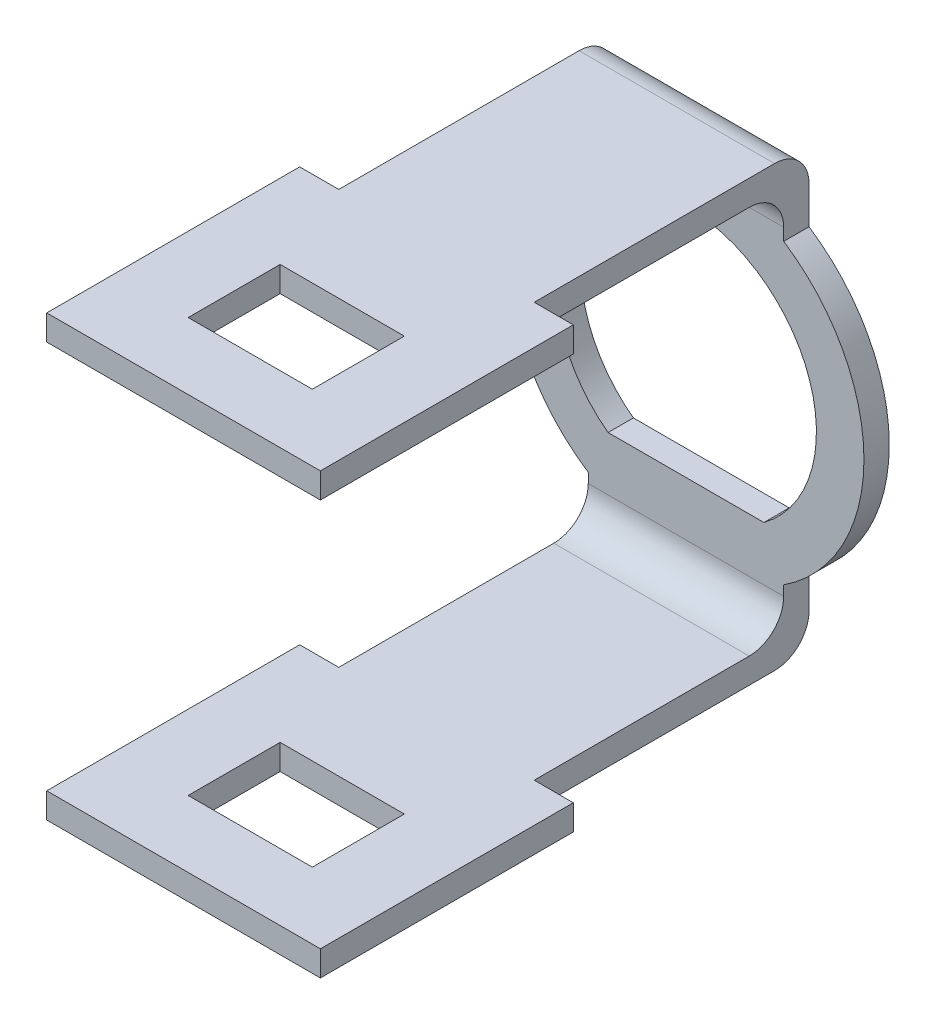
ISO-10303-21;
HEADER;
FILE_DESCRIPTION(('STEP AP214'),'2;1');
FILE_NAME('part.step','',(''),(''),'','','');
FILE_SCHEMA(('AUTOMOTIVE_DESIGN { 1 0 10303 214 1 1 1 1 }'));
ENDSEC;
DATA;
#1=APPLICATION_CONTEXT('core data for automotive mechanical design processes');
#2=APPLICATION_PROTOCOL_DEFINITION('international standard','automotive_design',2000,#1);
#3=PRODUCT_CONTEXT('',#1,'mechanical');
#4=PRODUCT('Part','Part','',(#3));
#5=PRODUCT_RELATED_PRODUCT_CATEGORY('part','',(#4));
#6=PRODUCT_DEFINITION_FORMATION('','',#4);
#7=PRODUCT_DEFINITION_CONTEXT('part definition',#1,'design');
#8=PRODUCT_DEFINITION('design','',#6,#7);
#9=PRODUCT_DEFINITION_SHAPE('','',#8);
#10=(LENGTH_UNIT() NAMED_UNIT(*) SI_UNIT(.MILLI.,.METRE.));
#11=(NAMED_UNIT(*) PLANE_ANGLE_UNIT() SI_UNIT($,.RADIAN.));
#12=(NAMED_UNIT(*) SI_UNIT($,.STERADIAN.) SOLID_ANGLE_UNIT());
#13=UNCERTAINTY_MEASURE_WITH_UNIT(LENGTH_MEASURE(1.E-05),#10,'distance_accuracy_value','');
#14=(GEOMETRIC_REPRESENTATION_CONTEXT(3) GLOBAL_UNCERTAINTY_ASSIGNED_CONTEXT((#13)) GLOBAL_UNIT_ASSIGNED_CONTEXT((#10,
#11,#12)) REPRESENTATION_CONTEXT('',''));
#15=CARTESIAN_POINT('',(0.,0.,0.));
#16=DIRECTION('',(0.,0.,1.));
#17=DIRECTION('',(1.,0.,0.));
#18=AXIS2_PLACEMENT_3D('',#15,#16,#17);
#19=CARTESIAN_POINT('',(0.,0.,1.1));
#20=DIRECTION('',(0.,0.,-1.));
#21=DIRECTION('',(-1.,0.,0.));
#22=AXIS2_PLACEMENT_3D('',#19,#20,#21);
#23=CYLINDRICAL_SURFACE('',#22,7.75);
#24=DIRECTION('',(0.,0.,-1.));
#25=VECTOR('',#24,1.);
#26=CARTESIAN_POINT('',(-4.25,-6.48074069840786,1.1));
#27=LINE('',#26,#25);
#28=CARTESIAN_POINT('',(-4.25,-6.48074069840786,1.1));
#29=VERTEX_POINT('',#28);
#30=CARTESIAN_POINT('',(-4.25,-6.48074069840786,0.));
#31=VERTEX_POINT('',#30);
#32=EDGE_CURVE('E42',#29,#31,#27,.T.);
#33=ORIENTED_EDGE('',*,*,#32,.F.);
#34=CARTESIAN_POINT('',(0.,0.,1.1));
#35=DIRECTION('',(0.,0.,1.));
#36=DIRECTION('',(1.,0.,0.));
#37=AXIS2_PLACEMENT_3D('',#34,#35,#36);
#38=CIRCLE('',#37,7.75);
#39=CARTESIAN_POINT('',(-4.25,6.48074069840786,1.1));
#40=VERTEX_POINT('',#39);
#41=EDGE_CURVE('E583',#40,#29,#38,.T.);
#42=ORIENTED_EDGE('',*,*,#41,.F.);
#43=DIRECTION('',(0.,0.,-1.));
#44=VECTOR('',#43,1.);
#45=CARTESIAN_POINT('',(-4.25,6.48074069840786,1.1));
#46=LINE('',#45,#44);
#47=CARTESIAN_POINT('',(-4.25,6.48074069840786,0.));
#48=VERTEX_POINT('',#47);
#49=EDGE_CURVE('E586',#40,#48,#46,.T.);
#50=ORIENTED_EDGE('',*,*,#49,.T.);
#51=CARTESIAN_POINT('',(0.,0.,0.));
#52=DIRECTION('',(0.,0.,1.));
#53=DIRECTION('',(1.,0.,0.));
#54=AXIS2_PLACEMENT_3D('',#51,#52,#53);
#55=CIRCLE('',#54,7.75);
#56=EDGE_CURVE('E584',#48,#31,#55,.T.);
#57=ORIENTED_EDGE('',*,*,#56,.T.);
#58=EDGE_LOOP('',(#33,#42,#50,#57));
#59=FACE_BOUND('',#58,.T.);
#60=ADVANCED_FACE('F33',(#59),#23,.T.);
#61=CARTESIAN_POINT('',(0.,0.,1.1));
#62=DIRECTION('',(0.,0.,1.));
#63=DIRECTION('',(1.,0.,0.));
#64=AXIS2_PLACEMENT_3D('',#61,#62,#63);
#65=PLANE('',#64);
#66=CARTESIAN_POINT('',(0.,0.,1.1));
#67=DIRECTION('',(0.,0.,1.));
#68=DIRECTION('',(1.,0.,0.));
#69=AXIS2_PLACEMENT_3D('',#66,#67,#68);
#70=CIRCLE('',#69,7.73994275668608);
#71=CARTESIAN_POINT('',(4.25,-6.46871037199667,1.1));
#72=VERTEX_POINT('',#71);
#73=CARTESIAN_POINT('',(4.25,6.46871037199667,1.1));
#74=VERTEX_POINT('',#73);
#75=EDGE_CURVE('E49',#72,#74,#70,.T.);
#76=ORIENTED_EDGE('',*,*,#75,.T.);
#77=DIRECTION('',(0.,-1.,0.));
#78=VECTOR('',#77,1.);
#79=CARTESIAN_POINT('',(4.25,6.20982383979651,1.1));
#80=LINE('',#79,#78);
#81=CARTESIAN_POINT('',(4.25,6.99999999999999,1.1));
#82=VERTEX_POINT('',#81);
#83=EDGE_CURVE('E371',#82,#74,#80,.T.);
#84=ORIENTED_EDGE('',*,*,#83,.F.);
#85=DIRECTION('',(-1.,0.,0.));
#86=VECTOR('',#85,1.);
#87=CARTESIAN_POINT('',(4.25,6.99999999999999,1.1));
#88=LINE('',#87,#86);
#89=CARTESIAN_POINT('',(-4.25,6.99999999999999,1.1));
#90=VERTEX_POINT('',#89);
#91=EDGE_CURVE('E441',#82,#90,#88,.T.);
#92=ORIENTED_EDGE('',*,*,#91,.T.);
#93=DIRECTION('',(0.,-1.,0.));
#94=VECTOR('',#93,1.);
#95=CARTESIAN_POINT('',(-4.25,6.20982383979651,1.1));
#96=LINE('',#95,#94);
#97=EDGE_CURVE('E336',#90,#40,#96,.T.);
#98=ORIENTED_EDGE('',*,*,#97,.T.);
#99=ORIENTED_EDGE('',*,*,#41,.T.);
#100=DIRECTION('',(0.,-1.,0.));
#101=VECTOR('',#100,1.);
#102=CARTESIAN_POINT('',(-4.25,-6.24507977865107,1.1));
#103=LINE('',#102,#101);
#104=CARTESIAN_POINT('',(-4.25,-6.89999999999999,1.1));
#105=VERTEX_POINT('',#104);
#106=EDGE_CURVE('E513',#29,#105,#103,.T.);
#107=ORIENTED_EDGE('',*,*,#106,.T.);
#108=DIRECTION('',(-1.,0.,0.));
#109=VECTOR('',#108,1.);
#110=CARTESIAN_POINT('',(4.25,-6.89999999999999,1.1));
#111=LINE('',#110,#109);
#112=CARTESIAN_POINT('',(4.25,-6.89999999999999,1.1));
#113=VERTEX_POINT('',#112);
#114=EDGE_CURVE('E561',#113,#105,#111,.T.);
#115=ORIENTED_EDGE('',*,*,#114,.F.);
#116=DIRECTION('',(0.,-1.,0.));
#117=VECTOR('',#116,1.);
#118=CARTESIAN_POINT('',(4.25,-6.24507977865107,1.1));
#119=LINE('',#118,#117);
#120=EDGE_CURVE('E548',#72,#113,#119,.T.);
#121=ORIENTED_EDGE('',*,*,#120,.F.);
#122=EDGE_LOOP('',(#76,#84,#92,#98,#99,#107,#115,#121));
#123=FACE_BOUND('',#122,.T.);
#124=DIRECTION('',(1.,0.,0.));
#125=VECTOR('',#124,1.);
#126=CARTESIAN_POINT('',(-3.38863708112185,-4.54945512908353,1.1));
#127=LINE('',#126,#125);
#128=CARTESIAN_POINT('',(-3.38863708112185,-4.54945512908353,1.1));
#129=VERTEX_POINT('',#128);
#130=CARTESIAN_POINT('',(3.38863708112185,-4.54945512908353,1.1));
#131=VERTEX_POINT('',#130);
#132=EDGE_CURVE('E568',#129,#131,#127,.T.);
#133=ORIENTED_EDGE('',*,*,#132,.F.);
#134=CARTESIAN_POINT('',(0.,0.,1.1));
#135=DIRECTION('',(0.,0.,1.));
#136=DIRECTION('',(1.,0.,0.));
#137=AXIS2_PLACEMENT_3D('',#134,#135,#136);
#138=CIRCLE('',#137,5.67277738317823);
#139=EDGE_CURVE('E565',#131,#129,#138,.T.);
#140=ORIENTED_EDGE('',*,*,#139,.F.);
#141=EDGE_LOOP('',(#133,#140));
#142=FACE_BOUND('',#141,.T.);
#143=ADVANCED_FACE('F619',(#123,#142),#65,.T.);
#144=CARTESIAN_POINT('',(0.,0.,0.));
#145=DIRECTION('',(0.,0.,1.));
#146=DIRECTION('',(1.,0.,0.));
#147=AXIS2_PLACEMENT_3D('',#144,#145,#146);
#148=PLANE('',#147);
#149=DIRECTION('',(0.,1.,0.));
#150=VECTOR('',#149,1.);
#151=CARTESIAN_POINT('',(4.25,6.20982383979651,0.));
#152=LINE('',#151,#150);
#153=CARTESIAN_POINT('',(4.25,6.46871037199667,0.));
#154=VERTEX_POINT('',#153);
#155=CARTESIAN_POINT('',(4.25,8.09999999999999,0.));
#156=VERTEX_POINT('',#155);
#157=EDGE_CURVE('E375',#154,#156,#152,.T.);
#158=ORIENTED_EDGE('',*,*,#157,.F.);
#159=CARTESIAN_POINT('',(0.,0.,0.));
#160=DIRECTION('',(0.,0.,1.));
#161=DIRECTION('',(1.,0.,0.));
#162=AXIS2_PLACEMENT_3D('',#159,#160,#161);
#163=CIRCLE('',#162,7.73994275668608);
#164=CARTESIAN_POINT('',(4.25,-6.46871037199667,0.));
#165=VERTEX_POINT('',#164);
#166=EDGE_CURVE('E581',#165,#154,#163,.T.);
#167=ORIENTED_EDGE('',*,*,#166,.F.);
#168=DIRECTION('',(0.,1.,0.));
#169=VECTOR('',#168,1.);
#170=CARTESIAN_POINT('',(4.25,-6.24507977865107,0.));
#171=LINE('',#170,#169);
#172=CARTESIAN_POINT('',(4.25,-7.99999999999999,0.));
#173=VERTEX_POINT('',#172);
#174=EDGE_CURVE('E525',#173,#165,#171,.T.);
#175=ORIENTED_EDGE('',*,*,#174,.F.);
#176=DIRECTION('',(-1.,0.,0.));
#177=VECTOR('',#176,1.);
#178=CARTESIAN_POINT('',(4.25,-7.99999999999999,0.));
#179=LINE('',#178,#177);
#180=CARTESIAN_POINT('',(-4.25,-7.99999999999999,0.));
#181=VERTEX_POINT('',#180);
#182=EDGE_CURVE('E554',#173,#181,#179,.T.);
#183=ORIENTED_EDGE('',*,*,#182,.T.);
#184=DIRECTION('',(0.,1.,0.));
#185=VECTOR('',#184,1.);
#186=CARTESIAN_POINT('',(-4.25,-6.24507977865107,0.));
#187=LINE('',#186,#185);
#188=EDGE_CURVE('E542',#181,#31,#187,.T.);
#189=ORIENTED_EDGE('',*,*,#188,.T.);
#190=ORIENTED_EDGE('',*,*,#56,.F.);
#191=DIRECTION('',(0.,1.,0.));
#192=VECTOR('',#191,1.);
#193=CARTESIAN_POINT('',(-4.25,6.20982383979651,0.));
#194=LINE('',#193,#192);
#195=CARTESIAN_POINT('',(-4.25,8.09999999999999,0.));
#196=VERTEX_POINT('',#195);
#197=EDGE_CURVE('E341',#48,#196,#194,.T.);
#198=ORIENTED_EDGE('',*,*,#197,.T.);
#199=DIRECTION('',(-1.,0.,0.));
#200=VECTOR('',#199,1.);
#201=CARTESIAN_POINT('',(4.25,8.09999999999999,0.));
#202=LINE('',#201,#200);
#203=EDGE_CURVE('E436',#156,#196,#202,.T.);
#204=ORIENTED_EDGE('',*,*,#203,.F.);
#205=EDGE_LOOP('',(#158,#167,#175,#183,#189,#190,#198,#204));
#206=FACE_BOUND('',#205,.T.);
#207=CARTESIAN_POINT('',(0.,0.,0.));
#208=DIRECTION('',(0.,0.,1.));
#209=DIRECTION('',(1.,0.,0.));
#210=AXIS2_PLACEMENT_3D('',#207,#208,#209);
#211=CIRCLE('',#210,5.67277738317823);
#212=CARTESIAN_POINT('',(3.38863708112185,-4.54945512908353,0.));
#213=VERTEX_POINT('',#212);
#214=CARTESIAN_POINT('',(-3.38863708112185,-4.54945512908353,0.));
#215=VERTEX_POINT('',#214);
#216=EDGE_CURVE('E564',#213,#215,#211,.T.);
#217=ORIENTED_EDGE('',*,*,#216,.T.);
#218=DIRECTION('',(1.,0.,0.));
#219=VECTOR('',#218,1.);
#220=CARTESIAN_POINT('',(-3.38863708112185,-4.54945512908353,0.));
#221=LINE('',#220,#219);
#222=EDGE_CURVE('E569',#215,#213,#221,.T.);
#223=ORIENTED_EDGE('',*,*,#222,.T.);
#224=EDGE_LOOP('',(#217,#223));
#225=FACE_BOUND('',#224,.T.);
#226=ADVANCED_FACE('F615',(#206,#225),#148,.F.);
#227=CARTESIAN_POINT('',(0.,0.,1.1));
#228=DIRECTION('',(0.,0.,-1.));
#229=DIRECTION('',(-1.,0.,0.));
#230=AXIS2_PLACEMENT_3D('',#227,#228,#229);
#231=CYLINDRICAL_SURFACE('',#230,7.73994275668608);
#232=ORIENTED_EDGE('',*,*,#75,.F.);
#233=DIRECTION('',(0.,0.,-1.));
#234=VECTOR('',#233,1.);
#235=CARTESIAN_POINT('',(4.25,-6.46871037199667,1.1));
#236=LINE('',#235,#234);
#237=EDGE_CURVE('E11',#72,#165,#236,.T.);
#238=ORIENTED_EDGE('',*,*,#237,.T.);
#239=ORIENTED_EDGE('',*,*,#166,.T.);
#240=DIRECTION('',(0.,0.,-1.));
#241=VECTOR('',#240,1.);
#242=CARTESIAN_POINT('',(4.25,6.46871037199667,1.1));
#243=LINE('',#242,#241);
#244=EDGE_CURVE('E591',#74,#154,#243,.T.);
#245=ORIENTED_EDGE('',*,*,#244,.F.);
#246=EDGE_LOOP('',(#232,#238,#239,#245));
#247=FACE_BOUND('',#246,.T.);
#248=ADVANCED_FACE('F35',(#247),#231,.T.);
#249=CARTESIAN_POINT('',(0.,0.,1.1));
#250=DIRECTION('',(0.,0.,-1.));
#251=DIRECTION('',(-1.,0.,0.));
#252=AXIS2_PLACEMENT_3D('',#249,#250,#251);
#253=CYLINDRICAL_SURFACE('',#252,5.67277738317823);
#254=ORIENTED_EDGE('',*,*,#216,.F.);
#255=DIRECTION('',(0.,0.,-1.));
#256=VECTOR('',#255,1.);
#257=CARTESIAN_POINT('',(3.38863708112185,-4.54945512908353,1.1));
#258=LINE('',#257,#256);
#259=EDGE_CURVE('E571',#131,#213,#258,.T.);
#260=ORIENTED_EDGE('',*,*,#259,.F.);
#261=ORIENTED_EDGE('',*,*,#139,.T.);
#262=DIRECTION('',(0.,0.,-1.));
#263=VECTOR('',#262,1.);
#264=CARTESIAN_POINT('',(-3.38863708112185,-4.54945512908353,1.1));
#265=LINE('',#264,#263);
#266=EDGE_CURVE('E578',#129,#215,#265,.T.);
#267=ORIENTED_EDGE('',*,*,#266,.T.);
#268=EDGE_LOOP('',(#254,#260,#261,#267));
#269=FACE_BOUND('',#268,.T.);
#270=ADVANCED_FACE('F680',(#269),#253,.F.);
#271=CARTESIAN_POINT('',(-3.38863708112185,-4.54945512908353,1.1));
#272=DIRECTION('',(0.,1.,0.));
#273=DIRECTION('',(-1.,0.,0.));
#274=AXIS2_PLACEMENT_3D('',#271,#272,#273);
#275=PLANE('',#274);
#276=ORIENTED_EDGE('',*,*,#222,.F.);
#277=ORIENTED_EDGE('',*,*,#266,.F.);
#278=ORIENTED_EDGE('',*,*,#132,.T.);
#279=ORIENTED_EDGE('',*,*,#259,.T.);
#280=EDGE_LOOP('',(#276,#277,#278,#279));
#281=FACE_BOUND('',#280,.T.);
#282=ADVANCED_FACE('F683',(#281),#275,.T.);
#283=CARTESIAN_POINT('',(4.25,-6.9,2.6));
#284=DIRECTION('',(1.,0.,0.));
#285=DIRECTION('',(0.,0.,-1.));
#286=AXIS2_PLACEMENT_3D('',#283,#284,#285);
#287=PLANE('',#286);
#288=ORIENTED_EDGE('',*,*,#237,.F.);
#289=ORIENTED_EDGE('',*,*,#120,.T.);
#290=CARTESIAN_POINT('',(4.25,-6.9,2.6));
#291=DIRECTION('',(-1.,0.,0.));
#292=DIRECTION('',(0.,0.,-1.));
#293=AXIS2_PLACEMENT_3D('',#290,#291,#292);
#294=CIRCLE('',#293,1.5);
#295=CARTESIAN_POINT('',(4.25,-8.4,2.60000000000001));
#296=VERTEX_POINT('',#295);
#297=EDGE_CURVE('E552',#113,#296,#294,.T.);
#298=ORIENTED_EDGE('',*,*,#297,.T.);
#299=DIRECTION('',(0.,0.,1.));
#300=VECTOR('',#299,1.);
#301=CARTESIAN_POINT('',(4.25,-8.4,11.95));
#302=LINE('',#301,#300);
#303=CARTESIAN_POINT('',(4.25,-8.4,11.95));
#304=VERTEX_POINT('',#303);
#305=EDGE_CURVE('E600',#296,#304,#302,.T.);
#306=ORIENTED_EDGE('',*,*,#305,.T.);
#307=DIRECTION('',(0.,-1.,0.));
#308=VECTOR('',#307,1.);
#309=CARTESIAN_POINT('',(4.25,-9.5,11.95));
#310=LINE('',#309,#308);
#311=CARTESIAN_POINT('',(4.25,-9.5,11.95));
#312=VERTEX_POINT('',#311);
#313=EDGE_CURVE('E595',#304,#312,#310,.T.);
#314=ORIENTED_EDGE('',*,*,#313,.T.);
#315=DIRECTION('',(0.,0.,-1.));
#316=VECTOR('',#315,1.);
#317=CARTESIAN_POINT('',(4.25,-9.5,11.95));
#318=LINE('',#317,#316);
#319=CARTESIAN_POINT('',(4.25,-9.5,1.50000000000001));
#320=VERTEX_POINT('',#319);
#321=EDGE_CURVE('E599',#312,#320,#318,.T.);
#322=ORIENTED_EDGE('',*,*,#321,.T.);
#323=CARTESIAN_POINT('',(4.25,-8.,1.5));
#324=DIRECTION('',(1.,0.,0.));
#325=DIRECTION('',(0.,0.,-1.));
#326=AXIS2_PLACEMENT_3D('',#323,#324,#325);
#327=CIRCLE('',#326,1.5);
#328=EDGE_CURVE('E604',#320,#173,#327,.T.);
#329=ORIENTED_EDGE('',*,*,#328,.T.);
#330=ORIENTED_EDGE('',*,*,#174,.T.);
#331=EDGE_LOOP('',(#288,#289,#298,#306,#314,#322,#329,#330));
#332=FACE_BOUND('',#331,.T.);
#333=ADVANCED_FACE('F609',(#332),#287,.T.);
#334=CARTESIAN_POINT('',(-4.25,-6.9,2.6));
#335=DIRECTION('',(1.,0.,0.));
#336=DIRECTION('',(0.,0.,-1.));
#337=AXIS2_PLACEMENT_3D('',#334,#335,#336);
#338=PLANE('',#337);
#339=ORIENTED_EDGE('',*,*,#106,.F.);
#340=ORIENTED_EDGE('',*,*,#32,.T.);
#341=ORIENTED_EDGE('',*,*,#188,.F.);
#342=CARTESIAN_POINT('',(-4.25,-8.,1.5));
#343=DIRECTION('',(1.,0.,0.));
#344=DIRECTION('',(0.,0.,-1.));
#345=AXIS2_PLACEMENT_3D('',#342,#343,#344);
#346=CIRCLE('',#345,1.5);
#347=CARTESIAN_POINT('',(-4.25,-9.5,1.50000000000001));
#348=VERTEX_POINT('',#347);
#349=EDGE_CURVE('E530',#348,#181,#346,.T.);
#350=ORIENTED_EDGE('',*,*,#349,.F.);
#351=DIRECTION('',(0.,0.,-1.));
#352=VECTOR('',#351,1.);
#353=CARTESIAN_POINT('',(-4.25,-9.5,11.95));
#354=LINE('',#353,#352);
#355=CARTESIAN_POINT('',(-4.25,-9.5,11.95));
#356=VERTEX_POINT('',#355);
#357=EDGE_CURVE('E535',#356,#348,#354,.T.);
#358=ORIENTED_EDGE('',*,*,#357,.F.);
#359=DIRECTION('',(0.,-1.,0.));
#360=VECTOR('',#359,1.);
#361=CARTESIAN_POINT('',(-4.25,-9.5,11.95));
#362=LINE('',#361,#360);
#363=CARTESIAN_POINT('',(-4.25,-8.4,11.95));
#364=VERTEX_POINT('',#363);
#365=EDGE_CURVE('E533',#364,#356,#362,.T.);
#366=ORIENTED_EDGE('',*,*,#365,.F.);
#367=DIRECTION('',(0.,0.,1.));
#368=VECTOR('',#367,1.);
#369=CARTESIAN_POINT('',(-4.25,-8.4,11.95));
#370=LINE('',#369,#368);
#371=CARTESIAN_POINT('',(-4.25,-8.4,2.60000000000001));
#372=VERTEX_POINT('',#371);
#373=EDGE_CURVE('E522',#372,#364,#370,.T.);
#374=ORIENTED_EDGE('',*,*,#373,.F.);
#375=CARTESIAN_POINT('',(-4.25,-6.9,2.6));
#376=DIRECTION('',(-1.,0.,0.));
#377=DIRECTION('',(0.,0.,-1.));
#378=AXIS2_PLACEMENT_3D('',#375,#376,#377);
#379=CIRCLE('',#378,1.5);
#380=EDGE_CURVE('E517',#105,#372,#379,.T.);
#381=ORIENTED_EDGE('',*,*,#380,.F.);
#382=EDGE_LOOP('',(#339,#340,#341,#350,#358,#366,#374,#381));
#383=FACE_BOUND('',#382,.T.);
#384=ADVANCED_FACE('F638',(#383),#338,.F.);
#385=CARTESIAN_POINT('',(4.25,-6.9,2.6));
#386=DIRECTION('',(-1.,0.,0.));
#387=DIRECTION('',(0.,0.,1.));
#388=AXIS2_PLACEMENT_3D('',#385,#386,#387);
#389=CYLINDRICAL_SURFACE('',#388,1.5);
#390=ORIENTED_EDGE('',*,*,#380,.T.);
#391=DIRECTION('',(-1.,0.,0.));
#392=VECTOR('',#391,1.);
#393=CARTESIAN_POINT('',(4.25,-8.4,2.60000000000001));
#394=LINE('',#393,#392);
#395=EDGE_CURVE('E558',#296,#372,#394,.T.);
#396=ORIENTED_EDGE('',*,*,#395,.F.);
#397=ORIENTED_EDGE('',*,*,#297,.F.);
#398=ORIENTED_EDGE('',*,*,#114,.T.);
#399=EDGE_LOOP('',(#390,#396,#397,#398));
#400=FACE_BOUND('',#399,.T.);
#401=ADVANCED_FACE('F622',(#400),#389,.F.);
#402=CARTESIAN_POINT('',(4.25,-8.4,11.95));
#403=DIRECTION('',(0.,-1.,0.));
#404=DIRECTION('',(0.,0.,-1.));
#405=AXIS2_PLACEMENT_3D('',#402,#403,#404);
#406=PLANE('',#405);
#407=ORIENTED_EDGE('',*,*,#373,.T.);
#408=DIRECTION('',(1.,0.,0.));
#409=VECTOR('',#408,1.);
#410=CARTESIAN_POINT('',(5.95,-8.4,11.95));
#411=LINE('',#410,#409);
#412=CARTESIAN_POINT('',(-5.95,-8.4,11.95));
#413=VERTEX_POINT('',#412);
#414=EDGE_CURVE('E479',#413,#364,#411,.T.);
#415=ORIENTED_EDGE('',*,*,#414,.F.);
#416=DIRECTION('',(0.,0.,-1.));
#417=VECTOR('',#416,1.);
#418=CARTESIAN_POINT('',(-5.95,-8.4,22.95));
#419=LINE('',#418,#417);
#420=CARTESIAN_POINT('',(-5.95,-8.4,22.95));
#421=VERTEX_POINT('',#420);
#422=EDGE_CURVE('E498',#421,#413,#419,.T.);
#423=ORIENTED_EDGE('',*,*,#422,.F.);
#424=DIRECTION('',(-1.,0.,0.));
#425=VECTOR('',#424,1.);
#426=CARTESIAN_POINT('',(5.95,-8.4,22.95));
#427=LINE('',#426,#425);
#428=CARTESIAN_POINT('',(5.95,-8.4,22.95));
#429=VERTEX_POINT('',#428);
#430=EDGE_CURVE('E647',#429,#421,#427,.T.);
#431=ORIENTED_EDGE('',*,*,#430,.F.);
#432=DIRECTION('',(0.,0.,1.));
#433=VECTOR('',#432,1.);
#434=CARTESIAN_POINT('',(5.95,-8.4,22.95));
#435=LINE('',#434,#433);
#436=CARTESIAN_POINT('',(5.95,-8.4,11.95));
#437=VERTEX_POINT('',#436);
#438=EDGE_CURVE('E474',#437,#429,#435,.T.);
#439=ORIENTED_EDGE('',*,*,#438,.F.);
#440=EDGE_CURVE('E495',#304,#437,#411,.T.);
#441=ORIENTED_EDGE('',*,*,#440,.F.);
#442=ORIENTED_EDGE('',*,*,#305,.F.);
#443=ORIENTED_EDGE('',*,*,#395,.T.);
#444=EDGE_LOOP('',(#407,#415,#423,#431,#439,#441,#442,#443));
#445=FACE_BOUND('',#444,.T.);
#446=DIRECTION('',(0.,0.,-1.));
#447=VECTOR('',#446,1.);
#448=CARTESIAN_POINT('',(-2.7,-8.4,20.05));
#449=LINE('',#448,#447);
#450=CARTESIAN_POINT('',(-2.7,-8.4,20.05));
#451=VERTEX_POINT('',#450);
#452=CARTESIAN_POINT('',(-2.7,-8.4,16.05));
#453=VERTEX_POINT('',#452);
#454=EDGE_CURVE('E447',#451,#453,#449,.T.);
#455=ORIENTED_EDGE('',*,*,#454,.T.);
#456=DIRECTION('',(1.,0.,0.));
#457=VECTOR('',#456,1.);
#458=CARTESIAN_POINT('',(2.7,-8.4,16.05));
#459=LINE('',#458,#457);
#460=CARTESIAN_POINT('',(2.7,-8.4,16.05));
#461=VERTEX_POINT('',#460);
#462=EDGE_CURVE('E439',#453,#461,#459,.T.);
#463=ORIENTED_EDGE('',*,*,#462,.T.);
#464=DIRECTION('',(0.,0.,1.));
#465=VECTOR('',#464,1.);
#466=CARTESIAN_POINT('',(2.7,-8.4,20.05));
#467=LINE('',#466,#465);
#468=CARTESIAN_POINT('',(2.7,-8.4,20.05));
#469=VERTEX_POINT('',#468);
#470=EDGE_CURVE('E457',#461,#469,#467,.T.);
#471=ORIENTED_EDGE('',*,*,#470,.T.);
#472=DIRECTION('',(-1.,0.,0.));
#473=VECTOR('',#472,1.);
#474=CARTESIAN_POINT('',(-2.7,-8.4,20.05));
#475=LINE('',#474,#473);
#476=EDGE_CURVE('E460',#469,#451,#475,.T.);
#477=ORIENTED_EDGE('',*,*,#476,.T.);
#478=EDGE_LOOP('',(#455,#463,#471,#477));
#479=FACE_BOUND('',#478,.T.);
#480=ADVANCED_FACE('F634',(#445,#479),#406,.F.);
#481=CARTESIAN_POINT('',(4.25,-9.5,11.95));
#482=DIRECTION('',(0.,1.,0.));
#483=DIRECTION('',(0.,0.,1.));
#484=AXIS2_PLACEMENT_3D('',#481,#482,#483);
#485=PLANE('',#484);
#486=ORIENTED_EDGE('',*,*,#357,.T.);
#487=DIRECTION('',(-1.,0.,0.));
#488=VECTOR('',#487,1.);
#489=CARTESIAN_POINT('',(4.25,-9.5,1.50000000000001));
#490=LINE('',#489,#488);
#491=EDGE_CURVE('E556',#320,#348,#490,.T.);
#492=ORIENTED_EDGE('',*,*,#491,.F.);
#493=ORIENTED_EDGE('',*,*,#321,.F.);
#494=DIRECTION('',(1.,0.,0.));
#495=VECTOR('',#494,1.);
#496=CARTESIAN_POINT('',(5.95,-9.5,11.95));
#497=LINE('',#496,#495);
#498=CARTESIAN_POINT('',(5.95,-9.5,11.95));
#499=VERTEX_POINT('',#498);
#500=EDGE_CURVE('E483',#312,#499,#497,.T.);
#501=ORIENTED_EDGE('',*,*,#500,.T.);
#502=DIRECTION('',(0.,0.,1.));
#503=VECTOR('',#502,1.);
#504=CARTESIAN_POINT('',(5.95,-9.5,22.95));
#505=LINE('',#504,#503);
#506=CARTESIAN_POINT('',(5.95,-9.5,22.95));
#507=VERTEX_POINT('',#506);
#508=EDGE_CURVE('E475',#499,#507,#505,.T.);
#509=ORIENTED_EDGE('',*,*,#508,.T.);
#510=DIRECTION('',(-1.,0.,0.));
#511=VECTOR('',#510,1.);
#512=CARTESIAN_POINT('',(5.95,-9.5,22.95));
#513=LINE('',#512,#511);
#514=CARTESIAN_POINT('',(-5.95,-9.50000000000001,22.95));
#515=VERTEX_POINT('',#514);
#516=EDGE_CURVE('E478',#507,#515,#513,.T.);
#517=ORIENTED_EDGE('',*,*,#516,.T.);
#518=DIRECTION('',(0.,0.,-1.));
#519=VECTOR('',#518,1.);
#520=CARTESIAN_POINT('',(-5.95,-9.50000000000001,22.95));
#521=LINE('',#520,#519);
#522=CARTESIAN_POINT('',(-5.95,-9.5,11.95));
#523=VERTEX_POINT('',#522);
#524=EDGE_CURVE('E481',#515,#523,#521,.T.);
#525=ORIENTED_EDGE('',*,*,#524,.T.);
#526=EDGE_CURVE('E491',#523,#356,#497,.T.);
#527=ORIENTED_EDGE('',*,*,#526,.T.);
#528=EDGE_LOOP('',(#486,#492,#493,#501,#509,#517,#525,#527));
#529=FACE_BOUND('',#528,.T.);
#530=DIRECTION('',(1.,0.,0.));
#531=VECTOR('',#530,1.);
#532=CARTESIAN_POINT('',(2.7,-9.5,16.05));
#533=LINE('',#532,#531);
#534=CARTESIAN_POINT('',(-2.7,-9.5,16.05));
#535=VERTEX_POINT('',#534);
#536=CARTESIAN_POINT('',(2.7,-9.5,16.05));
#537=VERTEX_POINT('',#536);
#538=EDGE_CURVE('E444',#535,#537,#533,.T.);
#539=ORIENTED_EDGE('',*,*,#538,.F.);
#540=DIRECTION('',(0.,0.,-1.));
#541=VECTOR('',#540,1.);
#542=CARTESIAN_POINT('',(-2.7,-9.50000000000001,20.05));
#543=LINE('',#542,#541);
#544=CARTESIAN_POINT('',(-2.7,-9.5,20.05));
#545=VERTEX_POINT('',#544);
#546=EDGE_CURVE('E452',#545,#535,#543,.T.);
#547=ORIENTED_EDGE('',*,*,#546,.F.);
#548=DIRECTION('',(-1.,0.,0.));
#549=VECTOR('',#548,1.);
#550=CARTESIAN_POINT('',(-2.7,-9.50000000000001,20.05));
#551=LINE('',#550,#549);
#552=CARTESIAN_POINT('',(2.7,-9.5,20.05));
#553=VERTEX_POINT('',#552);
#554=EDGE_CURVE('E449',#553,#545,#551,.T.);
#555=ORIENTED_EDGE('',*,*,#554,.F.);
#556=DIRECTION('',(0.,0.,1.));
#557=VECTOR('',#556,1.);
#558=CARTESIAN_POINT('',(2.7,-9.5,20.05));
#559=LINE('',#558,#557);
#560=EDGE_CURVE('E446',#537,#553,#559,.T.);
#561=ORIENTED_EDGE('',*,*,#560,.F.);
#562=EDGE_LOOP('',(#539,#547,#555,#561));
#563=FACE_BOUND('',#562,.T.);
#564=ADVANCED_FACE('F611',(#529,#563),#485,.F.);
#565=CARTESIAN_POINT('',(4.25,-8.,1.5));
#566=DIRECTION('',(-1.,0.,0.));
#567=DIRECTION('',(0.,0.,1.));
#568=AXIS2_PLACEMENT_3D('',#565,#566,#567);
#569=CYLINDRICAL_SURFACE('',#568,1.5);
#570=ORIENTED_EDGE('',*,*,#349,.T.);
#571=ORIENTED_EDGE('',*,*,#182,.F.);
#572=ORIENTED_EDGE('',*,*,#328,.F.);
#573=ORIENTED_EDGE('',*,*,#491,.T.);
#574=EDGE_LOOP('',(#570,#571,#572,#573));
#575=FACE_BOUND('',#574,.T.);
#576=ADVANCED_FACE('F613',(#575),#569,.T.);
#577=CARTESIAN_POINT('',(5.95,-9.5,11.95));
#578=DIRECTION('',(0.,0.,1.));
#579=DIRECTION('',(1.,0.,0.));
#580=AXIS2_PLACEMENT_3D('',#577,#578,#579);
#581=PLANE('',#580);
#582=ORIENTED_EDGE('',*,*,#414,.T.);
#583=ORIENTED_EDGE('',*,*,#365,.T.);
#584=ORIENTED_EDGE('',*,*,#526,.F.);
#585=DIRECTION('',(0.,1.,0.));
#586=VECTOR('',#585,1.);
#587=CARTESIAN_POINT('',(-5.95,-9.5,11.95));
#588=LINE('',#587,#586);
#589=EDGE_CURVE('E506',#523,#413,#588,.T.);
#590=ORIENTED_EDGE('',*,*,#589,.T.);
#591=EDGE_LOOP('',(#582,#583,#584,#590));
#592=FACE_BOUND('',#591,.T.);
#593=ADVANCED_FACE('F641',(#592),#581,.F.);
#594=CARTESIAN_POINT('',(5.95,-9.5,22.95));
#595=DIRECTION('',(-1.,0.,0.));
#596=DIRECTION('',(0.,-1.,0.));
#597=AXIS2_PLACEMENT_3D('',#594,#595,#596);
#598=PLANE('',#597);
#599=ORIENTED_EDGE('',*,*,#438,.T.);
#600=DIRECTION('',(0.,1.,0.));
#601=VECTOR('',#600,1.);
#602=CARTESIAN_POINT('',(5.95,-9.5,22.95));
#603=LINE('',#602,#601);
#604=EDGE_CURVE('E511',#507,#429,#603,.T.);
#605=ORIENTED_EDGE('',*,*,#604,.F.);
#606=ORIENTED_EDGE('',*,*,#508,.F.);
#607=DIRECTION('',(0.,1.,0.));
#608=VECTOR('',#607,1.);
#609=CARTESIAN_POINT('',(5.95,-9.5,11.95));
#610=LINE('',#609,#608);
#611=EDGE_CURVE('E494',#499,#437,#610,.T.);
#612=ORIENTED_EDGE('',*,*,#611,.T.);
#613=EDGE_LOOP('',(#599,#605,#606,#612));
#614=FACE_BOUND('',#613,.T.);
#615=ADVANCED_FACE('F650',(#614),#598,.F.);
#616=CARTESIAN_POINT('',(5.95,-9.5,22.95));
#617=DIRECTION('',(0.,0.,-1.));
#618=DIRECTION('',(0.,1.,0.));
#619=AXIS2_PLACEMENT_3D('',#616,#617,#618);
#620=PLANE('',#619);
#621=ORIENTED_EDGE('',*,*,#430,.T.);
#622=DIRECTION('',(0.,1.,0.));
#623=VECTOR('',#622,1.);
#624=CARTESIAN_POINT('',(-5.95,-9.50000000000001,22.95));
#625=LINE('',#624,#623);
#626=EDGE_CURVE('E509',#515,#421,#625,.T.);
#627=ORIENTED_EDGE('',*,*,#626,.F.);
#628=ORIENTED_EDGE('',*,*,#516,.F.);
#629=ORIENTED_EDGE('',*,*,#604,.T.);
#630=EDGE_LOOP('',(#621,#627,#628,#629));
#631=FACE_BOUND('',#630,.T.);
#632=ADVANCED_FACE('F666',(#631),#620,.F.);
#633=CARTESIAN_POINT('',(-5.95,-9.50000000000001,22.95));
#634=DIRECTION('',(1.,0.,0.));
#635=DIRECTION('',(0.,1.,0.));
#636=AXIS2_PLACEMENT_3D('',#633,#634,#635);
#637=PLANE('',#636);
#638=ORIENTED_EDGE('',*,*,#422,.T.);
#639=ORIENTED_EDGE('',*,*,#589,.F.);
#640=ORIENTED_EDGE('',*,*,#524,.F.);
#641=ORIENTED_EDGE('',*,*,#626,.T.);
#642=EDGE_LOOP('',(#638,#639,#640,#641));
#643=FACE_BOUND('',#642,.T.);
#644=ADVANCED_FACE('F646',(#643),#637,.F.);
#645=ORIENTED_EDGE('',*,*,#313,.F.);
#646=ORIENTED_EDGE('',*,*,#440,.T.);
#647=ORIENTED_EDGE('',*,*,#611,.F.);
#648=ORIENTED_EDGE('',*,*,#500,.F.);
#649=EDGE_LOOP('',(#645,#646,#647,#648));
#650=FACE_BOUND('',#649,.T.);
#651=ADVANCED_FACE('F655',(#650),#581,.F.);
#652=CARTESIAN_POINT('',(2.7,-9.5,16.05));
#653=DIRECTION('',(0.,0.,1.));
#654=DIRECTION('',(0.,-1.,0.));
#655=AXIS2_PLACEMENT_3D('',#652,#653,#654);
#656=PLANE('',#655);
#657=ORIENTED_EDGE('',*,*,#462,.F.);
#658=DIRECTION('',(0.,1.,0.));
#659=VECTOR('',#658,1.);
#660=CARTESIAN_POINT('',(-2.7,-9.5,16.05));
#661=LINE('',#660,#659);
#662=EDGE_CURVE('E454',#535,#453,#661,.T.);
#663=ORIENTED_EDGE('',*,*,#662,.F.);
#664=ORIENTED_EDGE('',*,*,#538,.T.);
#665=DIRECTION('',(0.,1.,0.));
#666=VECTOR('',#665,1.);
#667=CARTESIAN_POINT('',(2.7,-9.5,16.05));
#668=LINE('',#667,#666);
#669=EDGE_CURVE('E471',#537,#461,#668,.T.);
#670=ORIENTED_EDGE('',*,*,#669,.T.);
#671=EDGE_LOOP('',(#657,#663,#664,#670));
#672=FACE_BOUND('',#671,.T.);
#673=ADVANCED_FACE('F657',(#672),#656,.T.);
#674=CARTESIAN_POINT('',(2.7,-9.5,20.05));
#675=DIRECTION('',(-1.,0.,0.));
#676=DIRECTION('',(0.,-1.,0.));
#677=AXIS2_PLACEMENT_3D('',#674,#675,#676);
#678=PLANE('',#677);
#679=ORIENTED_EDGE('',*,*,#470,.F.);
#680=ORIENTED_EDGE('',*,*,#669,.F.);
#681=ORIENTED_EDGE('',*,*,#560,.T.);
#682=DIRECTION('',(0.,1.,0.));
#683=VECTOR('',#682,1.);
#684=CARTESIAN_POINT('',(2.7,-9.5,20.05));
#685=LINE('',#684,#683);
#686=EDGE_CURVE('E469',#553,#469,#685,.T.);
#687=ORIENTED_EDGE('',*,*,#686,.T.);
#688=EDGE_LOOP('',(#679,#680,#681,#687));
#689=FACE_BOUND('',#688,.T.);
#690=ADVANCED_FACE('F663',(#689),#678,.T.);
#691=CARTESIAN_POINT('',(-2.7,-9.50000000000001,20.05));
#692=DIRECTION('',(0.,0.,-1.));
#693=DIRECTION('',(0.,1.,0.));
#694=AXIS2_PLACEMENT_3D('',#691,#692,#693);
#695=PLANE('',#694);
#696=ORIENTED_EDGE('',*,*,#476,.F.);
#697=ORIENTED_EDGE('',*,*,#686,.F.);
#698=ORIENTED_EDGE('',*,*,#554,.T.);
#699=DIRECTION('',(0.,1.,0.));
#700=VECTOR('',#699,1.);
#701=CARTESIAN_POINT('',(-2.7,-9.50000000000001,20.05));
#702=LINE('',#701,#700);
#703=EDGE_CURVE('E467',#545,#451,#702,.T.);
#704=ORIENTED_EDGE('',*,*,#703,.T.);
#705=EDGE_LOOP('',(#696,#697,#698,#704));
#706=FACE_BOUND('',#705,.T.);
#707=ADVANCED_FACE('F730',(#706),#695,.T.);
#708=CARTESIAN_POINT('',(-2.7,-9.50000000000001,20.05));
#709=DIRECTION('',(1.,0.,0.));
#710=DIRECTION('',(0.,1.,0.));
#711=AXIS2_PLACEMENT_3D('',#708,#709,#710);
#712=PLANE('',#711);
#713=ORIENTED_EDGE('',*,*,#454,.F.);
#714=ORIENTED_EDGE('',*,*,#703,.F.);
#715=ORIENTED_EDGE('',*,*,#546,.T.);
#716=ORIENTED_EDGE('',*,*,#662,.T.);
#717=EDGE_LOOP('',(#713,#714,#715,#716));
#718=FACE_BOUND('',#717,.T.);
#719=ADVANCED_FACE('F740',(#718),#712,.T.);
#720=CARTESIAN_POINT('',(4.25,7.,2.6));
#721=DIRECTION('',(-1.,0.,0.));
#722=DIRECTION('',(0.,0.,1.));
#723=AXIS2_PLACEMENT_3D('',#720,#721,#722);
#724=PLANE('',#723);
#725=ORIENTED_EDGE('',*,*,#83,.T.);
#726=ORIENTED_EDGE('',*,*,#244,.T.);
#727=ORIENTED_EDGE('',*,*,#157,.T.);
#728=CARTESIAN_POINT('',(4.25,8.1,1.5));
#729=DIRECTION('',(1.,0.,0.));
#730=DIRECTION('',(0.,0.,1.));
#731=AXIS2_PLACEMENT_3D('',#728,#729,#730);
#732=CIRCLE('',#731,1.5);
#733=CARTESIAN_POINT('',(4.25,9.6,1.50000000000001));
#734=VERTEX_POINT('',#733);
#735=EDGE_CURVE('E378',#156,#734,#732,.T.);
#736=ORIENTED_EDGE('',*,*,#735,.T.);
#737=DIRECTION('',(0.,0.,1.));
#738=VECTOR('',#737,1.);
#739=CARTESIAN_POINT('',(4.25,9.6,11.95));
#740=LINE('',#739,#738);
#741=CARTESIAN_POINT('',(4.25,9.6,11.95));
#742=VERTEX_POINT('',#741);
#743=EDGE_CURVE('E381',#734,#742,#740,.T.);
#744=ORIENTED_EDGE('',*,*,#743,.T.);
#745=DIRECTION('',(0.,-1.,0.));
#746=VECTOR('',#745,1.);
#747=CARTESIAN_POINT('',(4.25,9.6,11.95));
#748=LINE('',#747,#746);
#749=CARTESIAN_POINT('',(4.25,8.5,11.95));
#750=VERTEX_POINT('',#749);
#751=EDGE_CURVE('E384',#742,#750,#748,.T.);
#752=ORIENTED_EDGE('',*,*,#751,.T.);
#753=DIRECTION('',(0.,0.,-1.));
#754=VECTOR('',#753,1.);
#755=CARTESIAN_POINT('',(4.25,8.5,11.95));
#756=LINE('',#755,#754);
#757=CARTESIAN_POINT('',(4.25,8.5,2.60000000000001));
#758=VERTEX_POINT('',#757);
#759=EDGE_CURVE('E388',#750,#758,#756,.T.);
#760=ORIENTED_EDGE('',*,*,#759,.T.);
#761=CARTESIAN_POINT('',(4.25,7.,2.6));
#762=DIRECTION('',(-1.,0.,0.));
#763=DIRECTION('',(0.,0.,1.));
#764=AXIS2_PLACEMENT_3D('',#761,#762,#763);
#765=CIRCLE('',#764,1.5);
#766=EDGE_CURVE('E351',#758,#82,#765,.T.);
#767=ORIENTED_EDGE('',*,*,#766,.T.);
#768=EDGE_LOOP('',(#725,#726,#727,#736,#744,#752,#760,#767));
#769=FACE_BOUND('',#768,.T.);
#770=ADVANCED_FACE('F429',(#769),#724,.F.);
#771=CARTESIAN_POINT('',(-4.25,7.,2.6));
#772=DIRECTION('',(-1.,0.,0.));
#773=DIRECTION('',(0.,0.,1.));
#774=AXIS2_PLACEMENT_3D('',#771,#772,#773);
#775=PLANE('',#774);
#776=ORIENTED_EDGE('',*,*,#49,.F.);
#777=ORIENTED_EDGE('',*,*,#97,.F.);
#778=CARTESIAN_POINT('',(-4.25,7.,2.6));
#779=DIRECTION('',(-1.,0.,0.));
#780=DIRECTION('',(0.,0.,1.));
#781=AXIS2_PLACEMENT_3D('',#778,#779,#780);
#782=CIRCLE('',#781,1.5);
#783=CARTESIAN_POINT('',(-4.25,8.5,2.60000000000001));
#784=VERTEX_POINT('',#783);
#785=EDGE_CURVE('E358',#784,#90,#782,.T.);
#786=ORIENTED_EDGE('',*,*,#785,.F.);
#787=DIRECTION('',(0.,0.,-1.));
#788=VECTOR('',#787,1.);
#789=CARTESIAN_POINT('',(-4.25,8.5,11.95));
#790=LINE('',#789,#788);
#791=CARTESIAN_POINT('',(-4.25,8.5,11.95));
#792=VERTEX_POINT('',#791);
#793=EDGE_CURVE('E363',#792,#784,#790,.T.);
#794=ORIENTED_EDGE('',*,*,#793,.F.);
#795=DIRECTION('',(0.,-1.,0.));
#796=VECTOR('',#795,1.);
#797=CARTESIAN_POINT('',(-4.25,9.6,11.95));
#798=LINE('',#797,#796);
#799=CARTESIAN_POINT('',(-4.25,9.6,11.95));
#800=VERTEX_POINT('',#799);
#801=EDGE_CURVE('E361',#800,#792,#798,.T.);
#802=ORIENTED_EDGE('',*,*,#801,.F.);
#803=DIRECTION('',(0.,0.,1.));
#804=VECTOR('',#803,1.);
#805=CARTESIAN_POINT('',(-4.25,9.6,11.95));
#806=LINE('',#805,#804);
#807=CARTESIAN_POINT('',(-4.25,9.6,1.50000000000001));
#808=VERTEX_POINT('',#807);
#809=EDGE_CURVE('E355',#808,#800,#806,.T.);
#810=ORIENTED_EDGE('',*,*,#809,.F.);
#811=CARTESIAN_POINT('',(-4.25,8.1,1.5));
#812=DIRECTION('',(1.,0.,0.));
#813=DIRECTION('',(0.,0.,1.));
#814=AXIS2_PLACEMENT_3D('',#811,#812,#813);
#815=CIRCLE('',#814,1.5);
#816=EDGE_CURVE('E348',#196,#808,#815,.T.);
#817=ORIENTED_EDGE('',*,*,#816,.F.);
#818=ORIENTED_EDGE('',*,*,#197,.F.);
#819=EDGE_LOOP('',(#776,#777,#786,#794,#802,#810,#817,#818));
#820=FACE_BOUND('',#819,.T.);
#821=ADVANCED_FACE('F408',(#820),#775,.T.);
#822=CARTESIAN_POINT('',(4.25,8.1,1.5));
#823=DIRECTION('',(-1.,0.,0.));
#824=DIRECTION('',(0.,0.,1.));
#825=AXIS2_PLACEMENT_3D('',#822,#823,#824);
#826=CYLINDRICAL_SURFACE('',#825,1.5);
#827=ORIENTED_EDGE('',*,*,#816,.T.);
#828=DIRECTION('',(-1.,0.,0.));
#829=VECTOR('',#828,1.);
#830=CARTESIAN_POINT('',(4.25,9.6,1.50000000000001));
#831=LINE('',#830,#829);
#832=EDGE_CURVE('E405',#734,#808,#831,.T.);
#833=ORIENTED_EDGE('',*,*,#832,.F.);
#834=ORIENTED_EDGE('',*,*,#735,.F.);
#835=ORIENTED_EDGE('',*,*,#203,.T.);
#836=EDGE_LOOP('',(#827,#833,#834,#835));
#837=FACE_BOUND('',#836,.T.);
#838=ADVANCED_FACE('F435',(#837),#826,.T.);
#839=CARTESIAN_POINT('',(4.25,9.6,11.95));
#840=DIRECTION('',(0.,-1.,0.));
#841=DIRECTION('',(0.,0.,-1.));
#842=AXIS2_PLACEMENT_3D('',#839,#840,#841);
#843=PLANE('',#842);
#844=ORIENTED_EDGE('',*,*,#809,.T.);
#845=DIRECTION('',(-1.,0.,0.));
#846=VECTOR('',#845,1.);
#847=CARTESIAN_POINT('',(5.95,9.6,11.95));
#848=LINE('',#847,#846);
#849=CARTESIAN_POINT('',(-5.95,9.6,11.95));
#850=VERTEX_POINT('',#849);
#851=EDGE_CURVE('E300',#800,#850,#848,.T.);
#852=ORIENTED_EDGE('',*,*,#851,.T.);
#853=DIRECTION('',(0.,0.,1.));
#854=VECTOR('',#853,1.);
#855=CARTESIAN_POINT('',(-5.95,9.6,11.95));
#856=LINE('',#855,#854);
#857=CARTESIAN_POINT('',(-5.95,9.6,22.95));
#858=VERTEX_POINT('',#857);
#859=EDGE_CURVE('E304',#850,#858,#856,.T.);
#860=ORIENTED_EDGE('',*,*,#859,.T.);
#861=DIRECTION('',(1.,0.,0.));
#862=VECTOR('',#861,1.);
#863=CARTESIAN_POINT('',(-5.95,9.6,22.95));
#864=LINE('',#863,#862);
#865=CARTESIAN_POINT('',(5.95,9.6,22.95));
#866=VERTEX_POINT('',#865);
#867=EDGE_CURVE('E329',#858,#866,#864,.T.);
#868=ORIENTED_EDGE('',*,*,#867,.T.);
#869=DIRECTION('',(0.,0.,-1.));
#870=VECTOR('',#869,1.);
#871=CARTESIAN_POINT('',(5.95,9.6,22.95));
#872=LINE('',#871,#870);
#873=CARTESIAN_POINT('',(5.95,9.6,11.95));
#874=VERTEX_POINT('',#873);
#875=EDGE_CURVE('E297',#866,#874,#872,.T.);
#876=ORIENTED_EDGE('',*,*,#875,.T.);
#877=EDGE_CURVE('E310',#874,#742,#848,.T.);
#878=ORIENTED_EDGE('',*,*,#877,.T.);
#879=ORIENTED_EDGE('',*,*,#743,.F.);
#880=ORIENTED_EDGE('',*,*,#832,.T.);
#881=EDGE_LOOP('',(#844,#852,#860,#868,#876,#878,#879,#880));
#882=FACE_BOUND('',#881,.T.);
#883=DIRECTION('',(0.,0.,-1.));
#884=VECTOR('',#883,1.);
#885=CARTESIAN_POINT('',(2.7,9.6,20.05));
#886=LINE('',#885,#884);
#887=CARTESIAN_POINT('',(2.7,9.6,20.05));
#888=VERTEX_POINT('',#887);
#889=CARTESIAN_POINT('',(2.7,9.6,16.05));
#890=VERTEX_POINT('',#889);
#891=EDGE_CURVE('E265',#888,#890,#886,.T.);
#892=ORIENTED_EDGE('',*,*,#891,.F.);
#893=DIRECTION('',(1.,0.,0.));
#894=VECTOR('',#893,1.);
#895=CARTESIAN_POINT('',(-2.7,9.6,20.05));
#896=LINE('',#895,#894);
#897=CARTESIAN_POINT('',(-2.7,9.6,20.05));
#898=VERTEX_POINT('',#897);
#899=EDGE_CURVE('E255',#898,#888,#896,.T.);
#900=ORIENTED_EDGE('',*,*,#899,.F.);
#901=DIRECTION('',(0.,0.,1.));
#902=VECTOR('',#901,1.);
#903=CARTESIAN_POINT('',(-2.7,9.6,16.05));
#904=LINE('',#903,#902);
#905=CARTESIAN_POINT('',(-2.7,9.6,16.05));
#906=VERTEX_POINT('',#905);
#907=EDGE_CURVE('E281',#906,#898,#904,.T.);
#908=ORIENTED_EDGE('',*,*,#907,.F.);
#909=DIRECTION('',(-1.,0.,0.));
#910=VECTOR('',#909,1.);
#911=CARTESIAN_POINT('',(2.7,9.6,16.05));
#912=LINE('',#911,#910);
#913=EDGE_CURVE('E279',#890,#906,#912,.T.);
#914=ORIENTED_EDGE('',*,*,#913,.F.);
#915=EDGE_LOOP('',(#892,#900,#908,#914));
#916=FACE_BOUND('',#915,.T.);
#917=ADVANCED_FACE('F277',(#882,#916),#843,.F.);
#918=CARTESIAN_POINT('',(4.25,8.5,11.95));
#919=DIRECTION('',(0.,1.,0.));
#920=DIRECTION('',(0.,0.,1.));
#921=AXIS2_PLACEMENT_3D('',#918,#919,#920);
#922=PLANE('',#921);
#923=ORIENTED_EDGE('',*,*,#793,.T.);
#924=DIRECTION('',(-1.,0.,0.));
#925=VECTOR('',#924,1.);
#926=CARTESIAN_POINT('',(4.25,8.5,2.60000000000001));
#927=LINE('',#926,#925);
#928=EDGE_CURVE('E437',#758,#784,#927,.T.);
#929=ORIENTED_EDGE('',*,*,#928,.F.);
#930=ORIENTED_EDGE('',*,*,#759,.F.);
#931=DIRECTION('',(-1.,0.,0.));
#932=VECTOR('',#931,1.);
#933=CARTESIAN_POINT('',(5.95,8.5,11.95));
#934=LINE('',#933,#932);
#935=CARTESIAN_POINT('',(5.95,8.5,11.95));
#936=VERTEX_POINT('',#935);
#937=EDGE_CURVE('E316',#936,#750,#934,.T.);
#938=ORIENTED_EDGE('',*,*,#937,.F.);
#939=DIRECTION('',(0.,0.,-1.));
#940=VECTOR('',#939,1.);
#941=CARTESIAN_POINT('',(5.95,8.5,22.95));
#942=LINE('',#941,#940);
#943=CARTESIAN_POINT('',(5.95,8.5,22.95));
#944=VERTEX_POINT('',#943);
#945=EDGE_CURVE('E273',#944,#936,#942,.T.);
#946=ORIENTED_EDGE('',*,*,#945,.F.);
#947=DIRECTION('',(1.,0.,0.));
#948=VECTOR('',#947,1.);
#949=CARTESIAN_POINT('',(-5.95,8.5,22.95));
#950=LINE('',#949,#948);
#951=CARTESIAN_POINT('',(-5.95,8.5,22.95));
#952=VERTEX_POINT('',#951);
#953=EDGE_CURVE('E301',#952,#944,#950,.T.);
#954=ORIENTED_EDGE('',*,*,#953,.F.);
#955=DIRECTION('',(0.,0.,1.));
#956=VECTOR('',#955,1.);
#957=CARTESIAN_POINT('',(-5.95,8.5,11.95));
#958=LINE('',#957,#956);
#959=CARTESIAN_POINT('',(-5.95,8.5,11.95));
#960=VERTEX_POINT('',#959);
#961=EDGE_CURVE('E321',#960,#952,#958,.T.);
#962=ORIENTED_EDGE('',*,*,#961,.F.);
#963=EDGE_CURVE('E313',#792,#960,#934,.T.);
#964=ORIENTED_EDGE('',*,*,#963,.F.);
#965=EDGE_LOOP('',(#923,#929,#930,#938,#946,#954,#962,#964));
#966=FACE_BOUND('',#965,.T.);
#967=DIRECTION('',(1.,0.,0.));
#968=VECTOR('',#967,1.);
#969=CARTESIAN_POINT('',(-2.7,8.5,20.05));
#970=LINE('',#969,#968);
#971=CARTESIAN_POINT('',(-2.7,8.5,20.05));
#972=VERTEX_POINT('',#971);
#973=CARTESIAN_POINT('',(2.7,8.5,20.05));
#974=VERTEX_POINT('',#973);
#975=EDGE_CURVE('E285',#972,#974,#970,.T.);
#976=ORIENTED_EDGE('',*,*,#975,.T.);
#977=DIRECTION('',(0.,0.,-1.));
#978=VECTOR('',#977,1.);
#979=CARTESIAN_POINT('',(2.7,8.5,20.05));
#980=LINE('',#979,#978);
#981=CARTESIAN_POINT('',(2.7,8.5,16.05));
#982=VERTEX_POINT('',#981);
#983=EDGE_CURVE('E272',#974,#982,#980,.T.);
#984=ORIENTED_EDGE('',*,*,#983,.T.);
#985=DIRECTION('',(-1.,0.,0.));
#986=VECTOR('',#985,1.);
#987=CARTESIAN_POINT('',(2.7,8.5,16.05));
#988=LINE('',#987,#986);
#989=CARTESIAN_POINT('',(-2.7,8.5,16.05));
#990=VERTEX_POINT('',#989);
#991=EDGE_CURVE('E288',#982,#990,#988,.T.);
#992=ORIENTED_EDGE('',*,*,#991,.T.);
#993=DIRECTION('',(0.,0.,1.));
#994=VECTOR('',#993,1.);
#995=CARTESIAN_POINT('',(-2.7,8.5,16.05));
#996=LINE('',#995,#994);
#997=EDGE_CURVE('E266',#990,#972,#996,.T.);
#998=ORIENTED_EDGE('',*,*,#997,.T.);
#999=EDGE_LOOP('',(#976,#984,#992,#998));
#1000=FACE_BOUND('',#999,.T.);
#1001=ADVANCED_FACE('F412',(#966,#1000),#922,.F.);
#1002=CARTESIAN_POINT('',(4.25,7.,2.6));
#1003=DIRECTION('',(-1.,0.,0.));
#1004=DIRECTION('',(0.,0.,1.));
#1005=AXIS2_PLACEMENT_3D('',#1002,#1003,#1004);
#1006=CYLINDRICAL_SURFACE('',#1005,1.5);
#1007=ORIENTED_EDGE('',*,*,#785,.T.);
#1008=ORIENTED_EDGE('',*,*,#91,.F.);
#1009=ORIENTED_EDGE('',*,*,#766,.F.);
#1010=ORIENTED_EDGE('',*,*,#928,.T.);
#1011=EDGE_LOOP('',(#1007,#1008,#1009,#1010));
#1012=FACE_BOUND('',#1011,.T.);
#1013=ADVANCED_FACE('F794',(#1012),#1006,.F.);
#1014=CARTESIAN_POINT('',(5.95,9.6,11.95));
#1015=DIRECTION('',(0.,0.,1.));
#1016=DIRECTION('',(1.,0.,0.));
#1017=AXIS2_PLACEMENT_3D('',#1014,#1015,#1016);
#1018=PLANE('',#1017);
#1019=ORIENTED_EDGE('',*,*,#851,.F.);
#1020=ORIENTED_EDGE('',*,*,#801,.T.);
#1021=ORIENTED_EDGE('',*,*,#963,.T.);
#1022=DIRECTION('',(0.,-1.,0.));
#1023=VECTOR('',#1022,1.);
#1024=CARTESIAN_POINT('',(-5.95,9.6,11.95));
#1025=LINE('',#1024,#1023);
#1026=EDGE_CURVE('E332',#850,#960,#1025,.T.);
#1027=ORIENTED_EDGE('',*,*,#1026,.F.);
#1028=EDGE_LOOP('',(#1019,#1020,#1021,#1027));
#1029=FACE_BOUND('',#1028,.T.);
#1030=ADVANCED_FACE('F410',(#1029),#1018,.F.);
#1031=CARTESIAN_POINT('',(5.95,9.6,22.95));
#1032=DIRECTION('',(-1.,0.,0.));
#1033=DIRECTION('',(0.,-1.,0.));
#1034=AXIS2_PLACEMENT_3D('',#1031,#1032,#1033);
#1035=PLANE('',#1034);
#1036=ORIENTED_EDGE('',*,*,#945,.T.);
#1037=DIRECTION('',(0.,-1.,0.));
#1038=VECTOR('',#1037,1.);
#1039=CARTESIAN_POINT('',(5.95,9.6,11.95));
#1040=LINE('',#1039,#1038);
#1041=EDGE_CURVE('E334',#874,#936,#1040,.T.);
#1042=ORIENTED_EDGE('',*,*,#1041,.F.);
#1043=ORIENTED_EDGE('',*,*,#875,.F.);
#1044=DIRECTION('',(0.,-1.,0.));
#1045=VECTOR('',#1044,1.);
#1046=CARTESIAN_POINT('',(5.95,9.6,22.95));
#1047=LINE('',#1046,#1045);
#1048=EDGE_CURVE('E325',#866,#944,#1047,.T.);
#1049=ORIENTED_EDGE('',*,*,#1048,.T.);
#1050=EDGE_LOOP('',(#1036,#1042,#1043,#1049));
#1051=FACE_BOUND('',#1050,.T.);
#1052=ADVANCED_FACE('F426',(#1051),#1035,.F.);
#1053=ORIENTED_EDGE('',*,*,#751,.F.);
#1054=ORIENTED_EDGE('',*,*,#877,.F.);
#1055=ORIENTED_EDGE('',*,*,#1041,.T.);
#1056=ORIENTED_EDGE('',*,*,#937,.T.);
#1057=EDGE_LOOP('',(#1053,#1054,#1055,#1056));
#1058=FACE_BOUND('',#1057,.T.);
#1059=ADVANCED_FACE('F428',(#1058),#1018,.F.);
#1060=CARTESIAN_POINT('',(-5.95,9.6,11.95));
#1061=DIRECTION('',(1.,0.,0.));
#1062=DIRECTION('',(0.,1.,0.));
#1063=AXIS2_PLACEMENT_3D('',#1060,#1061,#1062);
#1064=PLANE('',#1063);
#1065=ORIENTED_EDGE('',*,*,#961,.T.);
#1066=DIRECTION('',(0.,-1.,0.));
#1067=VECTOR('',#1066,1.);
#1068=CARTESIAN_POINT('',(-5.95,9.6,22.95));
#1069=LINE('',#1068,#1067);
#1070=EDGE_CURVE('E328',#858,#952,#1069,.T.);
#1071=ORIENTED_EDGE('',*,*,#1070,.F.);
#1072=ORIENTED_EDGE('',*,*,#859,.F.);
#1073=ORIENTED_EDGE('',*,*,#1026,.T.);
#1074=EDGE_LOOP('',(#1065,#1071,#1072,#1073));
#1075=FACE_BOUND('',#1074,.T.);
#1076=ADVANCED_FACE('F418',(#1075),#1064,.F.);
#1077=CARTESIAN_POINT('',(-5.95,9.6,22.95));
#1078=DIRECTION('',(0.,0.,-1.));
#1079=DIRECTION('',(0.,1.,0.));
#1080=AXIS2_PLACEMENT_3D('',#1077,#1078,#1079);
#1081=PLANE('',#1080);
#1082=ORIENTED_EDGE('',*,*,#953,.T.);
#1083=ORIENTED_EDGE('',*,*,#1048,.F.);
#1084=ORIENTED_EDGE('',*,*,#867,.F.);
#1085=ORIENTED_EDGE('',*,*,#1070,.T.);
#1086=EDGE_LOOP('',(#1082,#1083,#1084,#1085));
#1087=FACE_BOUND('',#1086,.T.);
#1088=ADVANCED_FACE('F422',(#1087),#1081,.F.);
#1089=CARTESIAN_POINT('',(-2.7,9.6,20.05));
#1090=DIRECTION('',(0.,0.,-1.));
#1091=DIRECTION('',(0.,1.,0.));
#1092=AXIS2_PLACEMENT_3D('',#1089,#1090,#1091);
#1093=PLANE('',#1092);
#1094=ORIENTED_EDGE('',*,*,#975,.F.);
#1095=DIRECTION('',(0.,-1.,0.));
#1096=VECTOR('',#1095,1.);
#1097=CARTESIAN_POINT('',(-2.7,9.6,20.05));
#1098=LINE('',#1097,#1096);
#1099=EDGE_CURVE('E261',#898,#972,#1098,.T.);
#1100=ORIENTED_EDGE('',*,*,#1099,.F.);
#1101=ORIENTED_EDGE('',*,*,#899,.T.);
#1102=DIRECTION('',(0.,-1.,0.));
#1103=VECTOR('',#1102,1.);
#1104=CARTESIAN_POINT('',(2.7,9.6,20.05));
#1105=LINE('',#1104,#1103);
#1106=EDGE_CURVE('E258',#888,#974,#1105,.T.);
#1107=ORIENTED_EDGE('',*,*,#1106,.T.);
#1108=EDGE_LOOP('',(#1094,#1100,#1101,#1107));
#1109=FACE_BOUND('',#1108,.T.);
#1110=ADVANCED_FACE('F257',(#1109),#1093,.T.);
#1111=CARTESIAN_POINT('',(2.7,9.6,20.05));
#1112=DIRECTION('',(-1.,0.,0.));
#1113=DIRECTION('',(0.,-1.,0.));
#1114=AXIS2_PLACEMENT_3D('',#1111,#1112,#1113);
#1115=PLANE('',#1114);
#1116=ORIENTED_EDGE('',*,*,#983,.F.);
#1117=ORIENTED_EDGE('',*,*,#1106,.F.);
#1118=ORIENTED_EDGE('',*,*,#891,.T.);
#1119=DIRECTION('',(0.,-1.,0.));
#1120=VECTOR('',#1119,1.);
#1121=CARTESIAN_POINT('',(2.7,9.6,16.05));
#1122=LINE('',#1121,#1120);
#1123=EDGE_CURVE('E274',#890,#982,#1122,.T.);
#1124=ORIENTED_EDGE('',*,*,#1123,.T.);
#1125=EDGE_LOOP('',(#1116,#1117,#1118,#1124));
#1126=FACE_BOUND('',#1125,.T.);
#1127=ADVANCED_FACE('F269',(#1126),#1115,.T.);
#1128=CARTESIAN_POINT('',(2.7,9.6,16.05));
#1129=DIRECTION('',(0.,0.,1.));
#1130=DIRECTION('',(0.,-1.,0.));
#1131=AXIS2_PLACEMENT_3D('',#1128,#1129,#1130);
#1132=PLANE('',#1131);
#1133=ORIENTED_EDGE('',*,*,#991,.F.);
#1134=ORIENTED_EDGE('',*,*,#1123,.F.);
#1135=ORIENTED_EDGE('',*,*,#913,.T.);
#1136=DIRECTION('',(0.,-1.,0.));
#1137=VECTOR('',#1136,1.);
#1138=CARTESIAN_POINT('',(-2.7,9.6,16.05));
#1139=LINE('',#1138,#1137);
#1140=EDGE_CURVE('E294',#906,#990,#1139,.T.);
#1141=ORIENTED_EDGE('',*,*,#1140,.T.);
#1142=EDGE_LOOP('',(#1133,#1134,#1135,#1141));
#1143=FACE_BOUND('',#1142,.T.);
#1144=ADVANCED_FACE('F860',(#1143),#1132,.T.);
#1145=CARTESIAN_POINT('',(-2.7,9.6,16.05));
#1146=DIRECTION('',(1.,0.,0.));
#1147=DIRECTION('',(0.,1.,0.));
#1148=AXIS2_PLACEMENT_3D('',#1145,#1146,#1147);
#1149=PLANE('',#1148);
#1150=ORIENTED_EDGE('',*,*,#997,.F.);
#1151=ORIENTED_EDGE('',*,*,#1140,.F.);
#1152=ORIENTED_EDGE('',*,*,#907,.T.);
#1153=ORIENTED_EDGE('',*,*,#1099,.T.);
#1154=EDGE_LOOP('',(#1150,#1151,#1152,#1153));
#1155=FACE_BOUND('',#1154,.T.);
#1156=ADVANCED_FACE('F869',(#1155),#1149,.T.);
#1157=CLOSED_SHELL('',(#60,#143,#226,#248,#270,#282,#333,#384,#401,#480,#564,#576,#593,#615,
#632,#644,#651,#673,#690,#707,#719,#770,#821,#838,#917,#1001,#1013,#1030,#1052,#1059,#1076,
#1088,#1110,#1127,#1144,#1156));
#1158=MANIFOLD_SOLID_BREP('B2',#1157);
#1159=ADVANCED_BREP_SHAPE_REPRESENTATION('',(#18,#1158),#14);
#1160=SHAPE_DEFINITION_REPRESENTATION(#9,#1159);
ENDSEC;
END-ISO-10303-21;
